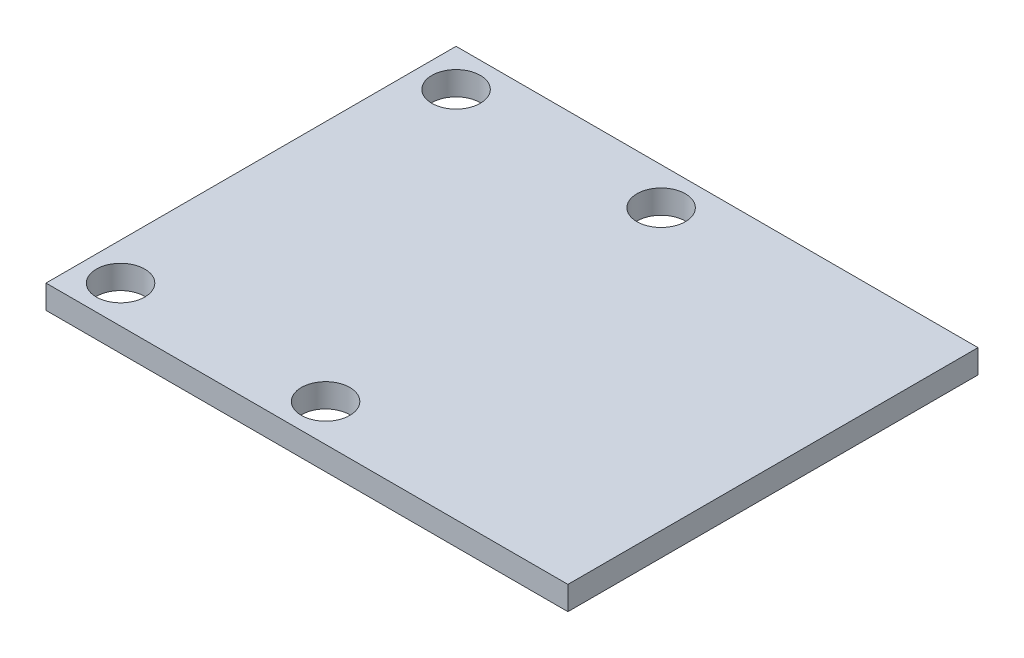
ISO-10303-21;
HEADER;
FILE_DESCRIPTION(('STEP AP214'),'2;1');
FILE_NAME('part.step','',(''),(''),'','','');
FILE_SCHEMA(('AUTOMOTIVE_DESIGN { 1 0 10303 214 1 1 1 1 }'));
ENDSEC;
DATA;
#1=APPLICATION_CONTEXT('core data for automotive mechanical design processes');
#2=APPLICATION_PROTOCOL_DEFINITION('international standard','automotive_design',2000,#1);
#3=PRODUCT_CONTEXT('',#1,'mechanical');
#4=PRODUCT('Part','Part','',(#3));
#5=PRODUCT_RELATED_PRODUCT_CATEGORY('part','',(#4));
#6=PRODUCT_DEFINITION_FORMATION('','',#4);
#7=PRODUCT_DEFINITION_CONTEXT('part definition',#1,'design');
#8=PRODUCT_DEFINITION('design','',#6,#7);
#9=PRODUCT_DEFINITION_SHAPE('','',#8);
#10=(LENGTH_UNIT() NAMED_UNIT(*) SI_UNIT(.MILLI.,.METRE.));
#11=(NAMED_UNIT(*) PLANE_ANGLE_UNIT() SI_UNIT($,.RADIAN.));
#12=(NAMED_UNIT(*) SI_UNIT($,.STERADIAN.) SOLID_ANGLE_UNIT());
#13=UNCERTAINTY_MEASURE_WITH_UNIT(LENGTH_MEASURE(1.E-05),#10,'distance_accuracy_value','');
#14=(GEOMETRIC_REPRESENTATION_CONTEXT(3) GLOBAL_UNCERTAINTY_ASSIGNED_CONTEXT((#13)) GLOBAL_UNIT_ASSIGNED_CONTEXT((#10,
#11,#12)) REPRESENTATION_CONTEXT('',''));
#15=CARTESIAN_POINT('',(0.,0.,0.));
#16=DIRECTION('',(0.,0.,1.));
#17=DIRECTION('',(1.,0.,0.));
#18=AXIS2_PLACEMENT_3D('',#15,#16,#17);
#19=CARTESIAN_POINT('',(-1.,1.27,9.));
#20=DIRECTION('',(0.,-1.,0.));
#21=DIRECTION('',(0.,0.,-1.));
#22=AXIS2_PLACEMENT_3D('',#19,#20,#21);
#23=CYLINDRICAL_SURFACE('',#22,1.2999974);
#24=CARTESIAN_POINT('',(-1.,1.27,9.));
#25=DIRECTION('',(0.,1.,0.));
#26=DIRECTION('',(0.,0.,1.));
#27=AXIS2_PLACEMENT_3D('',#24,#25,#26);
#28=CIRCLE('',#27,1.2999974);
#29=CARTESIAN_POINT('',(-1.,1.27,10.2999974));
#30=VERTEX_POINT('',#29);
#31=EDGE_CURVE('E47',#30,#30,#28,.T.);
#32=ORIENTED_EDGE('',*,*,#31,.T.);
#33=EDGE_LOOP('',(#32));
#34=FACE_BOUND('',#33,.T.);
#35=CARTESIAN_POINT('',(-1.,0.,9.));
#36=DIRECTION('',(0.,1.,0.));
#37=DIRECTION('',(0.,0.,1.));
#38=AXIS2_PLACEMENT_3D('',#35,#36,#37);
#39=CIRCLE('',#38,1.2999974);
#40=CARTESIAN_POINT('',(-1.,0.,10.2999974));
#41=VERTEX_POINT('',#40);
#42=EDGE_CURVE('E11',#41,#41,#39,.T.);
#43=ORIENTED_EDGE('',*,*,#42,.F.);
#44=EDGE_LOOP('',(#43));
#45=FACE_BOUND('',#44,.T.);
#46=ADVANCED_FACE('F38',(#34,#45),#23,.F.);
#47=CARTESIAN_POINT('',(-12.,1.27,9.));
#48=DIRECTION('',(0.,-1.,0.));
#49=DIRECTION('',(0.,0.,-1.));
#50=AXIS2_PLACEMENT_3D('',#47,#48,#49);
#51=CYLINDRICAL_SURFACE('',#50,1.2999974);
#52=CARTESIAN_POINT('',(-12.,1.27,9.));
#53=DIRECTION('',(0.,1.,0.));
#54=DIRECTION('',(0.,0.,1.));
#55=AXIS2_PLACEMENT_3D('',#52,#53,#54);
#56=CIRCLE('',#55,1.2999974);
#57=CARTESIAN_POINT('',(-12.,1.27,10.2999974));
#58=VERTEX_POINT('',#57);
#59=EDGE_CURVE('E128',#58,#58,#56,.T.);
#60=ORIENTED_EDGE('',*,*,#59,.T.);
#61=EDGE_LOOP('',(#60));
#62=FACE_BOUND('',#61,.T.);
#63=CARTESIAN_POINT('',(-12.,0.,9.));
#64=DIRECTION('',(0.,1.,0.));
#65=DIRECTION('',(0.,0.,1.));
#66=AXIS2_PLACEMENT_3D('',#63,#64,#65);
#67=CIRCLE('',#66,1.2999974);
#68=CARTESIAN_POINT('',(-12.,0.,10.2999974));
#69=VERTEX_POINT('',#68);
#70=EDGE_CURVE('E132',#69,#69,#67,.T.);
#71=ORIENTED_EDGE('',*,*,#70,.F.);
#72=EDGE_LOOP('',(#71));
#73=FACE_BOUND('',#72,.T.);
#74=ADVANCED_FACE('F159',(#62,#73),#51,.F.);
#75=CARTESIAN_POINT('',(-14.,1.27,-11.));
#76=DIRECTION('',(1.,0.,0.));
#77=DIRECTION('',(0.,0.,-1.));
#78=AXIS2_PLACEMENT_3D('',#75,#76,#77);
#79=PLANE('',#78);
#80=DIRECTION('',(0.,0.,1.));
#81=VECTOR('',#80,1.);
#82=CARTESIAN_POINT('',(-14.,0.,-11.));
#83=LINE('',#82,#81);
#84=CARTESIAN_POINT('',(-14.,0.,-11.));
#85=VERTEX_POINT('',#84);
#86=CARTESIAN_POINT('',(-14.,0.,11.));
#87=VERTEX_POINT('',#86);
#88=EDGE_CURVE('E111',#85,#87,#83,.T.);
#89=ORIENTED_EDGE('',*,*,#88,.T.);
#90=DIRECTION('',(0.,-1.,0.));
#91=VECTOR('',#90,1.);
#92=CARTESIAN_POINT('',(-14.,1.27,11.));
#93=LINE('',#92,#91);
#94=CARTESIAN_POINT('',(-14.,1.27,11.));
#95=VERTEX_POINT('',#94);
#96=EDGE_CURVE('E100',#95,#87,#93,.T.);
#97=ORIENTED_EDGE('',*,*,#96,.F.);
#98=DIRECTION('',(0.,0.,1.));
#99=VECTOR('',#98,1.);
#100=CARTESIAN_POINT('',(-14.,1.27,-11.));
#101=LINE('',#100,#99);
#102=CARTESIAN_POINT('',(-14.,1.27,-11.));
#103=VERTEX_POINT('',#102);
#104=EDGE_CURVE('E92',#103,#95,#101,.T.);
#105=ORIENTED_EDGE('',*,*,#104,.F.);
#106=DIRECTION('',(0.,-1.,0.));
#107=VECTOR('',#106,1.);
#108=CARTESIAN_POINT('',(-14.,1.27,-11.));
#109=LINE('',#108,#107);
#110=EDGE_CURVE('E107',#103,#85,#109,.T.);
#111=ORIENTED_EDGE('',*,*,#110,.T.);
#112=EDGE_LOOP('',(#89,#97,#105,#111));
#113=FACE_BOUND('',#112,.T.);
#114=ADVANCED_FACE('F164',(#113),#79,.F.);
#115=CARTESIAN_POINT('',(-14.,1.27,11.));
#116=DIRECTION('',(0.,0.,-1.));
#117=DIRECTION('',(-1.,0.,0.));
#118=AXIS2_PLACEMENT_3D('',#115,#116,#117);
#119=PLANE('',#118);
#120=DIRECTION('',(1.,0.,0.));
#121=VECTOR('',#120,1.);
#122=CARTESIAN_POINT('',(-14.,0.,11.));
#123=LINE('',#122,#121);
#124=CARTESIAN_POINT('',(14.,0.,11.));
#125=VERTEX_POINT('',#124);
#126=EDGE_CURVE('E98',#87,#125,#123,.T.);
#127=ORIENTED_EDGE('',*,*,#126,.T.);
#128=DIRECTION('',(0.,-1.,0.));
#129=VECTOR('',#128,1.);
#130=CARTESIAN_POINT('',(14.,1.27,11.));
#131=LINE('',#130,#129);
#132=CARTESIAN_POINT('',(14.,1.27,11.));
#133=VERTEX_POINT('',#132);
#134=EDGE_CURVE('E96',#133,#125,#131,.T.);
#135=ORIENTED_EDGE('',*,*,#134,.F.);
#136=DIRECTION('',(1.,0.,0.));
#137=VECTOR('',#136,1.);
#138=CARTESIAN_POINT('',(-14.,1.27,11.));
#139=LINE('',#138,#137);
#140=EDGE_CURVE('E86',#95,#133,#139,.T.);
#141=ORIENTED_EDGE('',*,*,#140,.F.);
#142=ORIENTED_EDGE('',*,*,#96,.T.);
#143=EDGE_LOOP('',(#127,#135,#141,#142));
#144=FACE_BOUND('',#143,.T.);
#145=ADVANCED_FACE('F97',(#144),#119,.F.);
#146=CARTESIAN_POINT('',(14.,1.27,-11.));
#147=DIRECTION('',(-1.,0.,0.));
#148=DIRECTION('',(0.,0.,1.));
#149=AXIS2_PLACEMENT_3D('',#146,#147,#148);
#150=PLANE('',#149);
#151=DIRECTION('',(0.,0.,-1.));
#152=VECTOR('',#151,1.);
#153=CARTESIAN_POINT('',(14.,0.,-11.));
#154=LINE('',#153,#152);
#155=CARTESIAN_POINT('',(14.,0.,-11.));
#156=VERTEX_POINT('',#155);
#157=EDGE_CURVE('E72',#125,#156,#154,.T.);
#158=ORIENTED_EDGE('',*,*,#157,.T.);
#159=DIRECTION('',(0.,-1.,0.));
#160=VECTOR('',#159,1.);
#161=CARTESIAN_POINT('',(14.,1.27,-11.));
#162=LINE('',#161,#160);
#163=CARTESIAN_POINT('',(14.,1.27,-11.));
#164=VERTEX_POINT('',#163);
#165=EDGE_CURVE('E101',#164,#156,#162,.T.);
#166=ORIENTED_EDGE('',*,*,#165,.F.);
#167=DIRECTION('',(0.,0.,-1.));
#168=VECTOR('',#167,1.);
#169=CARTESIAN_POINT('',(14.,1.27,-11.));
#170=LINE('',#169,#168);
#171=EDGE_CURVE('E90',#133,#164,#170,.T.);
#172=ORIENTED_EDGE('',*,*,#171,.F.);
#173=ORIENTED_EDGE('',*,*,#134,.T.);
#174=EDGE_LOOP('',(#158,#166,#172,#173));
#175=FACE_BOUND('',#174,.T.);
#176=ADVANCED_FACE('F103',(#175),#150,.F.);
#177=CARTESIAN_POINT('',(-14.,1.27,-11.));
#178=DIRECTION('',(0.,0.,1.));
#179=DIRECTION('',(1.,0.,0.));
#180=AXIS2_PLACEMENT_3D('',#177,#178,#179);
#181=PLANE('',#180);
#182=DIRECTION('',(-1.,0.,0.));
#183=VECTOR('',#182,1.);
#184=CARTESIAN_POINT('',(-14.,0.,-11.));
#185=LINE('',#184,#183);
#186=EDGE_CURVE('E78',#156,#85,#185,.T.);
#187=ORIENTED_EDGE('',*,*,#186,.T.);
#188=ORIENTED_EDGE('',*,*,#110,.F.);
#189=DIRECTION('',(-1.,0.,0.));
#190=VECTOR('',#189,1.);
#191=CARTESIAN_POINT('',(-14.,1.27,-11.));
#192=LINE('',#191,#190);
#193=EDGE_CURVE('E55',#164,#103,#192,.T.);
#194=ORIENTED_EDGE('',*,*,#193,.F.);
#195=ORIENTED_EDGE('',*,*,#165,.T.);
#196=EDGE_LOOP('',(#187,#188,#194,#195));
#197=FACE_BOUND('',#196,.T.);
#198=ADVANCED_FACE('F143',(#197),#181,.F.);
#199=CARTESIAN_POINT('',(0.,1.27,0.));
#200=DIRECTION('',(0.,1.,0.));
#201=DIRECTION('',(0.,0.,1.));
#202=AXIS2_PLACEMENT_3D('',#199,#200,#201);
#203=PLANE('',#202);
#204=CARTESIAN_POINT('',(-1.,1.27,-9.));
#205=DIRECTION('',(0.,1.,0.));
#206=DIRECTION('',(0.,0.,1.));
#207=AXIS2_PLACEMENT_3D('',#204,#205,#206);
#208=CIRCLE('',#207,1.2999974);
#209=CARTESIAN_POINT('',(-1.,1.27,-7.7000026));
#210=VERTEX_POINT('',#209);
#211=EDGE_CURVE('E234',#210,#210,#208,.T.);
#212=ORIENTED_EDGE('',*,*,#211,.F.);
#213=EDGE_LOOP('',(#212));
#214=FACE_BOUND('',#213,.T.);
#215=CARTESIAN_POINT('',(-12.,1.27,-9.));
#216=DIRECTION('',(0.,1.,0.));
#217=DIRECTION('',(0.,0.,1.));
#218=AXIS2_PLACEMENT_3D('',#215,#216,#217);
#219=CIRCLE('',#218,1.2999974);
#220=CARTESIAN_POINT('',(-12.,1.27,-7.7000026));
#221=VERTEX_POINT('',#220);
#222=EDGE_CURVE('E115',#221,#221,#219,.T.);
#223=ORIENTED_EDGE('',*,*,#222,.F.);
#224=EDGE_LOOP('',(#223));
#225=FACE_BOUND('',#224,.T.);
#226=ORIENTED_EDGE('',*,*,#104,.T.);
#227=ORIENTED_EDGE('',*,*,#140,.T.);
#228=ORIENTED_EDGE('',*,*,#171,.T.);
#229=ORIENTED_EDGE('',*,*,#193,.T.);
#230=EDGE_LOOP('',(#226,#227,#228,#229));
#231=FACE_BOUND('',#230,.T.);
#232=ORIENTED_EDGE('',*,*,#59,.F.);
#233=EDGE_LOOP('',(#232));
#234=FACE_BOUND('',#233,.T.);
#235=ORIENTED_EDGE('',*,*,#31,.F.);
#236=EDGE_LOOP('',(#235));
#237=FACE_BOUND('',#236,.T.);
#238=ADVANCED_FACE('F87',(#214,#225,#231,#234,#237),#203,.T.);
#239=CARTESIAN_POINT('',(0.,0.,0.));
#240=DIRECTION('',(0.,1.,0.));
#241=DIRECTION('',(0.,0.,1.));
#242=AXIS2_PLACEMENT_3D('',#239,#240,#241);
#243=PLANE('',#242);
#244=CARTESIAN_POINT('',(-1.,0.,-9.));
#245=DIRECTION('',(0.,1.,0.));
#246=DIRECTION('',(0.,0.,1.));
#247=AXIS2_PLACEMENT_3D('',#244,#245,#246);
#248=CIRCLE('',#247,1.2999974);
#249=CARTESIAN_POINT('',(-1.,0.,-7.7000026));
#250=VERTEX_POINT('',#249);
#251=EDGE_CURVE('E228',#250,#250,#248,.T.);
#252=ORIENTED_EDGE('',*,*,#251,.T.);
#253=EDGE_LOOP('',(#252));
#254=FACE_BOUND('',#253,.T.);
#255=CARTESIAN_POINT('',(-12.,0.,-9.));
#256=DIRECTION('',(0.,1.,0.));
#257=DIRECTION('',(0.,0.,1.));
#258=AXIS2_PLACEMENT_3D('',#255,#256,#257);
#259=CIRCLE('',#258,1.2999974);
#260=CARTESIAN_POINT('',(-12.,0.,-7.7000026));
#261=VERTEX_POINT('',#260);
#262=EDGE_CURVE('E225',#261,#261,#259,.T.);
#263=ORIENTED_EDGE('',*,*,#262,.T.);
#264=EDGE_LOOP('',(#263));
#265=FACE_BOUND('',#264,.T.);
#266=ORIENTED_EDGE('',*,*,#88,.F.);
#267=ORIENTED_EDGE('',*,*,#186,.F.);
#268=ORIENTED_EDGE('',*,*,#157,.F.);
#269=ORIENTED_EDGE('',*,*,#126,.F.);
#270=EDGE_LOOP('',(#266,#267,#268,#269));
#271=FACE_BOUND('',#270,.T.);
#272=ORIENTED_EDGE('',*,*,#70,.T.);
#273=EDGE_LOOP('',(#272));
#274=FACE_BOUND('',#273,.T.);
#275=ORIENTED_EDGE('',*,*,#42,.T.);
#276=EDGE_LOOP('',(#275));
#277=FACE_BOUND('',#276,.T.);
#278=ADVANCED_FACE('F142',(#254,#265,#271,#274,#277),#243,.F.);
#279=CARTESIAN_POINT('',(-12.,1.27,-9.));
#280=DIRECTION('',(0.,-1.,0.));
#281=DIRECTION('',(0.,0.,-1.));
#282=AXIS2_PLACEMENT_3D('',#279,#280,#281);
#283=CYLINDRICAL_SURFACE('',#282,1.2999974);
#284=ORIENTED_EDGE('',*,*,#222,.T.);
#285=EDGE_LOOP('',(#284));
#286=FACE_BOUND('',#285,.T.);
#287=ORIENTED_EDGE('',*,*,#262,.F.);
#288=EDGE_LOOP('',(#287));
#289=FACE_BOUND('',#288,.T.);
#290=ADVANCED_FACE('F150',(#286,#289),#283,.F.);
#291=CARTESIAN_POINT('',(-1.,1.27,-9.));
#292=DIRECTION('',(0.,-1.,0.));
#293=DIRECTION('',(0.,0.,-1.));
#294=AXIS2_PLACEMENT_3D('',#291,#292,#293);
#295=CYLINDRICAL_SURFACE('',#294,1.2999974);
#296=ORIENTED_EDGE('',*,*,#211,.T.);
#297=EDGE_LOOP('',(#296));
#298=FACE_BOUND('',#297,.T.);
#299=ORIENTED_EDGE('',*,*,#251,.F.);
#300=EDGE_LOOP('',(#299));
#301=FACE_BOUND('',#300,.T.);
#302=ADVANCED_FACE('F198',(#298,#301),#295,.F.);
#303=CLOSED_SHELL('',(#46,#74,#114,#145,#176,#198,#238,#278,#290,#302));
#304=MANIFOLD_SOLID_BREP('B2',#303);
#305=ADVANCED_BREP_SHAPE_REPRESENTATION('',(#18,#304),#14);
#306=SHAPE_DEFINITION_REPRESENTATION(#9,#305);
ENDSEC;
END-ISO-10303-21;
